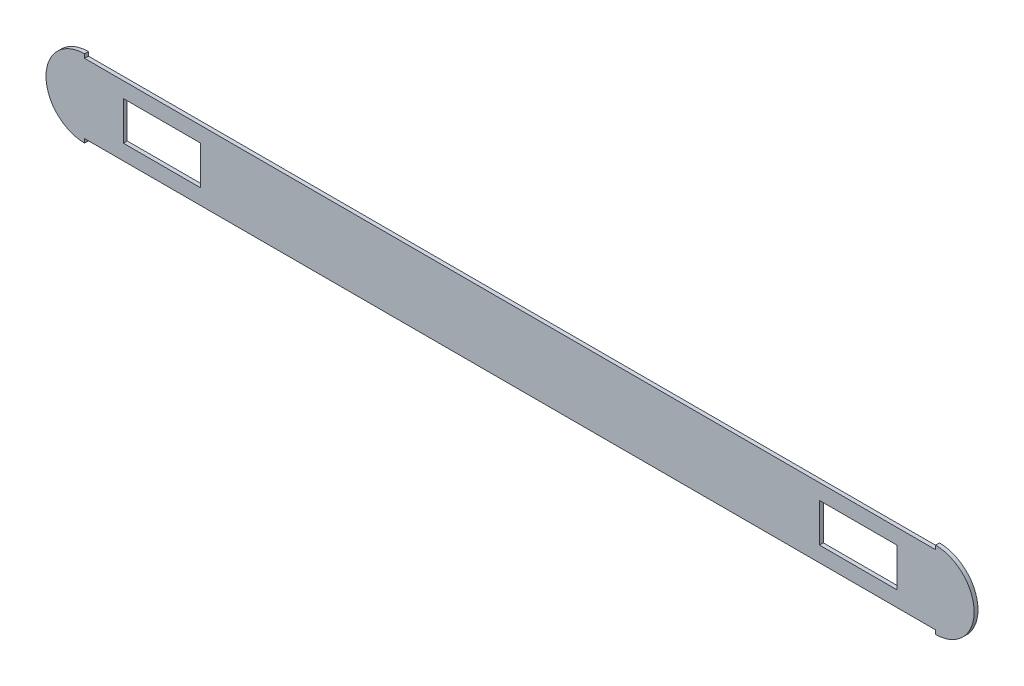
ISO-10303-21;
HEADER;
FILE_DESCRIPTION(('STEP AP214'),'2;1');
FILE_NAME('part.step','',(''),(''),'','','');
FILE_SCHEMA(('AUTOMOTIVE_DESIGN { 1 0 10303 214 1 1 1 1 }'));
ENDSEC;
DATA;
#1=APPLICATION_CONTEXT('core data for automotive mechanical design processes');
#2=APPLICATION_PROTOCOL_DEFINITION('international standard','automotive_design',2000,#1);
#3=PRODUCT_CONTEXT('',#1,'mechanical');
#4=PRODUCT('Part','Part','',(#3));
#5=PRODUCT_RELATED_PRODUCT_CATEGORY('part','',(#4));
#6=PRODUCT_DEFINITION_FORMATION('','',#4);
#7=PRODUCT_DEFINITION_CONTEXT('part definition',#1,'design');
#8=PRODUCT_DEFINITION('design','',#6,#7);
#9=PRODUCT_DEFINITION_SHAPE('','',#8);
#10=(LENGTH_UNIT() NAMED_UNIT(*) SI_UNIT(.MILLI.,.METRE.));
#11=(NAMED_UNIT(*) PLANE_ANGLE_UNIT() SI_UNIT($,.RADIAN.));
#12=(NAMED_UNIT(*) SI_UNIT($,.STERADIAN.) SOLID_ANGLE_UNIT());
#13=UNCERTAINTY_MEASURE_WITH_UNIT(LENGTH_MEASURE(1.E-05),#10,'distance_accuracy_value','');
#14=(GEOMETRIC_REPRESENTATION_CONTEXT(3) GLOBAL_UNCERTAINTY_ASSIGNED_CONTEXT((#13)) GLOBAL_UNIT_ASSIGNED_CONTEXT((#10,
#11,#12)) REPRESENTATION_CONTEXT('',''));
#15=CARTESIAN_POINT('',(0.,0.,0.));
#16=DIRECTION('',(0.,0.,1.));
#17=DIRECTION('',(1.,0.,0.));
#18=AXIS2_PLACEMENT_3D('',#15,#16,#17);
#19=CARTESIAN_POINT('',(597.266258042068,-45.,5.));
#20=DIRECTION('',(0.,0.,1.));
#21=DIRECTION('',(1.,0.,0.));
#22=AXIS2_PLACEMENT_3D('',#19,#20,#21);
#23=PLANE('',#22);
#24=DIRECTION('',(0.,1.,0.));
#25=VECTOR('',#24,1.);
#26=CARTESIAN_POINT('',(-502.833741957932,-50.1,5.));
#27=LINE('',#26,#25);
#28=CARTESIAN_POINT('',(-502.833741957932,-49.9998999999,5.));
#29=VERTEX_POINT('',#28);
#30=CARTESIAN_POINT('',(-502.833741957932,-44.9,5.));
#31=VERTEX_POINT('',#30);
#32=EDGE_CURVE('E148',#29,#31,#27,.T.);
#33=ORIENTED_EDGE('',*,*,#32,.T.);
#34=DIRECTION('',(1.,0.,0.));
#35=VECTOR('',#34,1.);
#36=CARTESIAN_POINT('',(-502.833741957932,-44.9,5.));
#37=LINE('',#36,#35);
#38=CARTESIAN_POINT('',(597.366258042068,-44.9,5.));
#39=VERTEX_POINT('',#38);
#40=EDGE_CURVE('E159',#31,#39,#37,.T.);
#41=ORIENTED_EDGE('',*,*,#40,.T.);
#42=DIRECTION('',(0.,-1.,0.));
#43=VECTOR('',#42,1.);
#44=CARTESIAN_POINT('',(597.366258042068,-44.9,5.));
#45=LINE('',#44,#43);
#46=CARTESIAN_POINT('',(597.366258042068,-49.9998999999,5.));
#47=VERTEX_POINT('',#46);
#48=EDGE_CURVE('E156',#39,#47,#45,.T.);
#49=ORIENTED_EDGE('',*,*,#48,.T.);
#50=CARTESIAN_POINT('',(597.266258042068,0.,5.));
#51=DIRECTION('',(0.,0.,1.));
#52=DIRECTION('',(1.,0.,0.));
#53=AXIS2_PLACEMENT_3D('',#50,#51,#52);
#54=CIRCLE('',#53,50.);
#55=CARTESIAN_POINT('',(597.366258042068,49.9998999999,5.));
#56=VERTEX_POINT('',#55);
#57=EDGE_CURVE('E53',#47,#56,#54,.T.);
#58=ORIENTED_EDGE('',*,*,#57,.T.);
#59=DIRECTION('',(0.,-1.,0.));
#60=VECTOR('',#59,1.);
#61=CARTESIAN_POINT('',(597.366258042068,50.1,5.));
#62=LINE('',#61,#60);
#63=CARTESIAN_POINT('',(597.366258042068,44.9,5.));
#64=VERTEX_POINT('',#63);
#65=EDGE_CURVE('E181',#56,#64,#62,.T.);
#66=ORIENTED_EDGE('',*,*,#65,.T.);
#67=DIRECTION('',(-1.,0.,0.));
#68=VECTOR('',#67,1.);
#69=CARTESIAN_POINT('',(597.366258042068,44.9,5.));
#70=LINE('',#69,#68);
#71=CARTESIAN_POINT('',(-502.833741957932,44.9,5.));
#72=VERTEX_POINT('',#71);
#73=EDGE_CURVE('E184',#64,#72,#70,.T.);
#74=ORIENTED_EDGE('',*,*,#73,.T.);
#75=DIRECTION('',(0.,1.,0.));
#76=VECTOR('',#75,1.);
#77=CARTESIAN_POINT('',(-502.833741957932,44.9,5.));
#78=LINE('',#77,#76);
#79=CARTESIAN_POINT('',(-502.833741957932,49.9998999999,5.));
#80=VERTEX_POINT('',#79);
#81=EDGE_CURVE('E179',#72,#80,#78,.T.);
#82=ORIENTED_EDGE('',*,*,#81,.T.);
#83=CARTESIAN_POINT('',(-502.733741957931,0.,5.));
#84=DIRECTION('',(0.,0.,1.));
#85=DIRECTION('',(1.,0.,0.));
#86=AXIS2_PLACEMENT_3D('',#83,#84,#85);
#87=CIRCLE('',#86,50.);
#88=EDGE_CURVE('E167',#80,#29,#87,.T.);
#89=ORIENTED_EDGE('',*,*,#88,.T.);
#90=EDGE_LOOP('',(#33,#41,#49,#58,#66,#74,#82,#89));
#91=FACE_BOUND('',#90,.T.);
#92=DIRECTION('',(0.,-1.,0.));
#93=VECTOR('',#92,1.);
#94=CARTESIAN_POINT('',(-452.733741957932,25.,5.));
#95=LINE('',#94,#93);
#96=CARTESIAN_POINT('',(-452.733741957932,25.,5.));
#97=VERTEX_POINT('',#96);
#98=CARTESIAN_POINT('',(-452.733741957931,-25.,5.));
#99=VERTEX_POINT('',#98);
#100=EDGE_CURVE('E201',#97,#99,#95,.T.);
#101=ORIENTED_EDGE('',*,*,#100,.F.);
#102=DIRECTION('',(-1.,0.,0.));
#103=VECTOR('',#102,1.);
#104=CARTESIAN_POINT('',(-452.733741957932,25.,5.));
#105=LINE('',#104,#103);
#106=CARTESIAN_POINT('',(-352.733741957931,25.,5.));
#107=VERTEX_POINT('',#106);
#108=EDGE_CURVE('E210',#107,#97,#105,.T.);
#109=ORIENTED_EDGE('',*,*,#108,.F.);
#110=DIRECTION('',(0.,1.,0.));
#111=VECTOR('',#110,1.);
#112=CARTESIAN_POINT('',(-352.733741957931,25.,5.));
#113=LINE('',#112,#111);
#114=CARTESIAN_POINT('',(-352.733741957931,-25.,5.));
#115=VERTEX_POINT('',#114);
#116=EDGE_CURVE('E207',#115,#107,#113,.T.);
#117=ORIENTED_EDGE('',*,*,#116,.F.);
#118=DIRECTION('',(1.,0.,0.));
#119=VECTOR('',#118,1.);
#120=CARTESIAN_POINT('',(-452.733741957932,-25.,5.));
#121=LINE('',#120,#119);
#122=EDGE_CURVE('E203',#99,#115,#121,.T.);
#123=ORIENTED_EDGE('',*,*,#122,.F.);
#124=EDGE_LOOP('',(#101,#109,#117,#123));
#125=FACE_BOUND('',#124,.T.);
#126=DIRECTION('',(0.,-1.,0.));
#127=VECTOR('',#126,1.);
#128=CARTESIAN_POINT('',(447.266258042068,25.,5.));
#129=LINE('',#128,#127);
#130=CARTESIAN_POINT('',(447.266258042068,25.,5.));
#131=VERTEX_POINT('',#130);
#132=CARTESIAN_POINT('',(447.266258042068,-25.,5.));
#133=VERTEX_POINT('',#132);
#134=EDGE_CURVE('E200',#131,#133,#129,.T.);
#135=ORIENTED_EDGE('',*,*,#134,.F.);
#136=DIRECTION('',(-1.,0.,0.));
#137=VECTOR('',#136,1.);
#138=CARTESIAN_POINT('',(447.266258042068,25.,5.));
#139=LINE('',#138,#137);
#140=CARTESIAN_POINT('',(547.266258042068,25.,5.));
#141=VERTEX_POINT('',#140);
#142=EDGE_CURVE('E230',#141,#131,#139,.T.);
#143=ORIENTED_EDGE('',*,*,#142,.F.);
#144=DIRECTION('',(0.,1.,0.));
#145=VECTOR('',#144,1.);
#146=CARTESIAN_POINT('',(547.266258042068,25.,5.));
#147=LINE('',#146,#145);
#148=CARTESIAN_POINT('',(547.266258042068,-25.,5.));
#149=VERTEX_POINT('',#148);
#150=EDGE_CURVE('E227',#149,#141,#147,.T.);
#151=ORIENTED_EDGE('',*,*,#150,.F.);
#152=DIRECTION('',(1.,0.,0.));
#153=VECTOR('',#152,1.);
#154=CARTESIAN_POINT('',(447.266258042068,-25.,5.));
#155=LINE('',#154,#153);
#156=EDGE_CURVE('E224',#133,#149,#155,.T.);
#157=ORIENTED_EDGE('',*,*,#156,.F.);
#158=EDGE_LOOP('',(#135,#143,#151,#157));
#159=FACE_BOUND('',#158,.T.);
#160=ADVANCED_FACE('F32',(#91,#125,#159),#23,.T.);
#161=CARTESIAN_POINT('',(-502.733741957931,0.,80.));
#162=DIRECTION('',(0.,0.,-1.));
#163=DIRECTION('',(-1.,0.,0.));
#164=AXIS2_PLACEMENT_3D('',#161,#162,#163);
#165=CYLINDRICAL_SURFACE('',#164,50.);
#166=CARTESIAN_POINT('',(-502.733741957931,0.,0.));
#167=DIRECTION('',(0.,0.,1.));
#168=DIRECTION('',(1.,0.,0.));
#169=AXIS2_PLACEMENT_3D('',#166,#167,#168);
#170=CIRCLE('',#169,50.);
#171=CARTESIAN_POINT('',(-502.833741957932,49.9998999999,0.));
#172=VERTEX_POINT('',#171);
#173=CARTESIAN_POINT('',(-502.833741957932,-49.9998999999,0.));
#174=VERTEX_POINT('',#173);
#175=EDGE_CURVE('E266',#172,#174,#170,.T.);
#176=ORIENTED_EDGE('',*,*,#175,.T.);
#177=DIRECTION('',(0.,0.,-1.));
#178=VECTOR('',#177,1.);
#179=CARTESIAN_POINT('',(-502.833741957932,-49.9998999999,80.));
#180=LINE('',#179,#178);
#181=EDGE_CURVE('E175',#174,#29,#180,.F.);
#182=ORIENTED_EDGE('',*,*,#181,.T.);
#183=ORIENTED_EDGE('',*,*,#88,.F.);
#184=DIRECTION('',(0.,0.,-1.));
#185=VECTOR('',#184,1.);
#186=CARTESIAN_POINT('',(-502.833741957932,49.9998999999,80.));
#187=LINE('',#186,#185);
#188=EDGE_CURVE('E195',#80,#172,#187,.T.);
#189=ORIENTED_EDGE('',*,*,#188,.T.);
#190=EDGE_LOOP('',(#176,#182,#183,#189));
#191=FACE_BOUND('',#190,.T.);
#192=ADVANCED_FACE('F290',(#191),#165,.T.);
#193=CARTESIAN_POINT('',(-502.733741957931,0.,0.));
#194=DIRECTION('',(0.,0.,1.));
#195=DIRECTION('',(1.,0.,0.));
#196=AXIS2_PLACEMENT_3D('',#193,#194,#195);
#197=PLANE('',#196);
#198=DIRECTION('',(1.,0.,0.));
#199=VECTOR('',#198,1.);
#200=CARTESIAN_POINT('',(-502.833741957932,-44.9,0.));
#201=LINE('',#200,#199);
#202=CARTESIAN_POINT('',(-502.833741957932,-44.9,0.));
#203=VERTEX_POINT('',#202);
#204=CARTESIAN_POINT('',(597.366258042068,-44.9,0.));
#205=VERTEX_POINT('',#204);
#206=EDGE_CURVE('E169',#203,#205,#201,.T.);
#207=ORIENTED_EDGE('',*,*,#206,.F.);
#208=DIRECTION('',(0.,1.,0.));
#209=VECTOR('',#208,1.);
#210=CARTESIAN_POINT('',(-502.833741957932,-50.1,0.));
#211=LINE('',#210,#209);
#212=EDGE_CURVE('E151',#174,#203,#211,.T.);
#213=ORIENTED_EDGE('',*,*,#212,.F.);
#214=ORIENTED_EDGE('',*,*,#175,.F.);
#215=DIRECTION('',(0.,1.,0.));
#216=VECTOR('',#215,1.);
#217=CARTESIAN_POINT('',(-502.833741957932,44.9,0.));
#218=LINE('',#217,#216);
#219=CARTESIAN_POINT('',(-502.833741957932,44.9,0.));
#220=VERTEX_POINT('',#219);
#221=EDGE_CURVE('E178',#220,#172,#218,.T.);
#222=ORIENTED_EDGE('',*,*,#221,.F.);
#223=DIRECTION('',(-1.,0.,0.));
#224=VECTOR('',#223,1.);
#225=CARTESIAN_POINT('',(597.366258042068,44.9,0.));
#226=LINE('',#225,#224);
#227=CARTESIAN_POINT('',(597.366258042068,44.9,0.));
#228=VERTEX_POINT('',#227);
#229=EDGE_CURVE('E182',#228,#220,#226,.T.);
#230=ORIENTED_EDGE('',*,*,#229,.F.);
#231=DIRECTION('',(0.,-1.,0.));
#232=VECTOR('',#231,1.);
#233=CARTESIAN_POINT('',(597.366258042068,50.1,0.));
#234=LINE('',#233,#232);
#235=CARTESIAN_POINT('',(597.366258042068,49.9998999999,0.));
#236=VERTEX_POINT('',#235);
#237=EDGE_CURVE('E189',#236,#228,#234,.T.);
#238=ORIENTED_EDGE('',*,*,#237,.F.);
#239=CARTESIAN_POINT('',(597.266258042068,0.,0.));
#240=DIRECTION('',(0.,0.,1.));
#241=DIRECTION('',(1.,0.,0.));
#242=AXIS2_PLACEMENT_3D('',#239,#240,#241);
#243=CIRCLE('',#242,50.);
#244=CARTESIAN_POINT('',(597.366258042068,-49.9998999999,0.));
#245=VERTEX_POINT('',#244);
#246=EDGE_CURVE('E264',#245,#236,#243,.T.);
#247=ORIENTED_EDGE('',*,*,#246,.F.);
#248=DIRECTION('',(0.,-1.,0.));
#249=VECTOR('',#248,1.);
#250=CARTESIAN_POINT('',(597.366258042068,-44.9,0.));
#251=LINE('',#250,#249);
#252=EDGE_CURVE('E46',#205,#245,#251,.T.);
#253=ORIENTED_EDGE('',*,*,#252,.F.);
#254=EDGE_LOOP('',(#207,#213,#214,#222,#230,#238,#247,#253));
#255=FACE_BOUND('',#254,.T.);
#256=DIRECTION('',(-1.,0.,0.));
#257=VECTOR('',#256,1.);
#258=CARTESIAN_POINT('',(-502.733741957931,25.,0.));
#259=LINE('',#258,#257);
#260=CARTESIAN_POINT('',(-352.733741957931,25.,0.));
#261=VERTEX_POINT('',#260);
#262=CARTESIAN_POINT('',(-452.733741957932,25.,0.));
#263=VERTEX_POINT('',#262);
#264=EDGE_CURVE('E258',#261,#263,#259,.T.);
#265=ORIENTED_EDGE('',*,*,#264,.T.);
#266=DIRECTION('',(0.,-1.,0.));
#267=VECTOR('',#266,1.);
#268=CARTESIAN_POINT('',(-452.733741957932,0.,0.));
#269=LINE('',#268,#267);
#270=CARTESIAN_POINT('',(-452.733741957932,-25.,0.));
#271=VERTEX_POINT('',#270);
#272=EDGE_CURVE('E261',#263,#271,#269,.T.);
#273=ORIENTED_EDGE('',*,*,#272,.T.);
#274=DIRECTION('',(1.,0.,0.));
#275=VECTOR('',#274,1.);
#276=CARTESIAN_POINT('',(-502.733741957931,-25.,0.));
#277=LINE('',#276,#275);
#278=CARTESIAN_POINT('',(-352.733741957931,-25.,0.));
#279=VERTEX_POINT('',#278);
#280=EDGE_CURVE('E252',#271,#279,#277,.T.);
#281=ORIENTED_EDGE('',*,*,#280,.T.);
#282=DIRECTION('',(0.,1.,0.));
#283=VECTOR('',#282,1.);
#284=CARTESIAN_POINT('',(-352.733741957931,0.,0.));
#285=LINE('',#284,#283);
#286=EDGE_CURVE('E255',#279,#261,#285,.T.);
#287=ORIENTED_EDGE('',*,*,#286,.T.);
#288=EDGE_LOOP('',(#265,#273,#281,#287));
#289=FACE_BOUND('',#288,.T.);
#290=DIRECTION('',(-1.,0.,0.));
#291=VECTOR('',#290,1.);
#292=CARTESIAN_POINT('',(-502.733741957931,25.0000000000004,0.));
#293=LINE('',#292,#291);
#294=CARTESIAN_POINT('',(547.266258042068,25.,0.));
#295=VERTEX_POINT('',#294);
#296=CARTESIAN_POINT('',(447.266258042068,25.,0.));
#297=VERTEX_POINT('',#296);
#298=EDGE_CURVE('E246',#295,#297,#293,.T.);
#299=ORIENTED_EDGE('',*,*,#298,.T.);
#300=DIRECTION('',(0.,-1.,0.));
#301=VECTOR('',#300,1.);
#302=CARTESIAN_POINT('',(447.266258042068,0.,0.));
#303=LINE('',#302,#301);
#304=CARTESIAN_POINT('',(447.266258042068,-25.,0.));
#305=VERTEX_POINT('',#304);
#306=EDGE_CURVE('E249',#297,#305,#303,.T.);
#307=ORIENTED_EDGE('',*,*,#306,.T.);
#308=DIRECTION('',(1.,0.,0.));
#309=VECTOR('',#308,1.);
#310=CARTESIAN_POINT('',(-502.733741957931,-25.,0.));
#311=LINE('',#310,#309);
#312=CARTESIAN_POINT('',(547.266258042068,-25.,0.));
#313=VERTEX_POINT('',#312);
#314=EDGE_CURVE('E216',#305,#313,#311,.T.);
#315=ORIENTED_EDGE('',*,*,#314,.T.);
#316=DIRECTION('',(0.,1.,0.));
#317=VECTOR('',#316,1.);
#318=CARTESIAN_POINT('',(547.266258042068,0.,0.));
#319=LINE('',#318,#317);
#320=EDGE_CURVE('E243',#313,#295,#319,.T.);
#321=ORIENTED_EDGE('',*,*,#320,.T.);
#322=EDGE_LOOP('',(#299,#307,#315,#321));
#323=FACE_BOUND('',#322,.T.);
#324=ADVANCED_FACE('F280',(#255,#289,#323),#197,.F.);
#325=CARTESIAN_POINT('',(447.266258042068,-25.,-5.));
#326=DIRECTION('',(0.,-1.,0.));
#327=DIRECTION('',(0.,0.,-1.));
#328=AXIS2_PLACEMENT_3D('',#325,#326,#327);
#329=PLANE('',#328);
#330=DIRECTION('',(0.,0.,1.));
#331=VECTOR('',#330,1.);
#332=CARTESIAN_POINT('',(447.266258042068,-25.,-5.));
#333=LINE('',#332,#331);
#334=EDGE_CURVE('E233',#305,#133,#333,.T.);
#335=ORIENTED_EDGE('',*,*,#334,.T.);
#336=ORIENTED_EDGE('',*,*,#156,.T.);
#337=DIRECTION('',(0.,0.,1.));
#338=VECTOR('',#337,1.);
#339=CARTESIAN_POINT('',(547.266258042068,-25.,-5.));
#340=LINE('',#339,#338);
#341=EDGE_CURVE('E237',#313,#149,#340,.T.);
#342=ORIENTED_EDGE('',*,*,#341,.F.);
#343=ORIENTED_EDGE('',*,*,#314,.F.);
#344=EDGE_LOOP('',(#335,#336,#342,#343));
#345=FACE_BOUND('',#344,.T.);
#346=ADVANCED_FACE('F294',(#345),#329,.F.);
#347=CARTESIAN_POINT('',(547.266258042068,25.,-5.));
#348=DIRECTION('',(1.,0.,0.));
#349=DIRECTION('',(0.,0.,-1.));
#350=AXIS2_PLACEMENT_3D('',#347,#348,#349);
#351=PLANE('',#350);
#352=ORIENTED_EDGE('',*,*,#341,.T.);
#353=ORIENTED_EDGE('',*,*,#150,.T.);
#354=DIRECTION('',(0.,0.,1.));
#355=VECTOR('',#354,1.);
#356=CARTESIAN_POINT('',(547.266258042068,25.,-5.));
#357=LINE('',#356,#355);
#358=EDGE_CURVE('E235',#295,#141,#357,.T.);
#359=ORIENTED_EDGE('',*,*,#358,.F.);
#360=ORIENTED_EDGE('',*,*,#320,.F.);
#361=EDGE_LOOP('',(#352,#353,#359,#360));
#362=FACE_BOUND('',#361,.T.);
#363=ADVANCED_FACE('F304',(#362),#351,.F.);
#364=CARTESIAN_POINT('',(447.266258042068,25.,-5.));
#365=DIRECTION('',(0.,1.,0.));
#366=DIRECTION('',(-1.,0.,0.));
#367=AXIS2_PLACEMENT_3D('',#364,#365,#366);
#368=PLANE('',#367);
#369=ORIENTED_EDGE('',*,*,#358,.T.);
#370=ORIENTED_EDGE('',*,*,#142,.T.);
#371=DIRECTION('',(0.,0.,1.));
#372=VECTOR('',#371,1.);
#373=CARTESIAN_POINT('',(447.266258042068,25.,-5.));
#374=LINE('',#373,#372);
#375=EDGE_CURVE('E204',#297,#131,#374,.T.);
#376=ORIENTED_EDGE('',*,*,#375,.F.);
#377=ORIENTED_EDGE('',*,*,#298,.F.);
#378=EDGE_LOOP('',(#369,#370,#376,#377));
#379=FACE_BOUND('',#378,.T.);
#380=ADVANCED_FACE('F316',(#379),#368,.F.);
#381=CARTESIAN_POINT('',(447.266258042068,25.,-5.));
#382=DIRECTION('',(-1.,0.,0.));
#383=DIRECTION('',(0.,0.,1.));
#384=AXIS2_PLACEMENT_3D('',#381,#382,#383);
#385=PLANE('',#384);
#386=ORIENTED_EDGE('',*,*,#375,.T.);
#387=ORIENTED_EDGE('',*,*,#134,.T.);
#388=ORIENTED_EDGE('',*,*,#334,.F.);
#389=ORIENTED_EDGE('',*,*,#306,.F.);
#390=EDGE_LOOP('',(#386,#387,#388,#389));
#391=FACE_BOUND('',#390,.T.);
#392=ADVANCED_FACE('F313',(#391),#385,.F.);
#393=CARTESIAN_POINT('',(-452.733741957932,-25.,-5.));
#394=DIRECTION('',(0.,-1.,0.));
#395=DIRECTION('',(0.,0.,-1.));
#396=AXIS2_PLACEMENT_3D('',#393,#394,#395);
#397=PLANE('',#396);
#398=DIRECTION('',(0.,0.,1.));
#399=VECTOR('',#398,1.);
#400=CARTESIAN_POINT('',(-452.733741957932,-25.,-5.));
#401=LINE('',#400,#399);
#402=EDGE_CURVE('E213',#271,#99,#401,.T.);
#403=ORIENTED_EDGE('',*,*,#402,.T.);
#404=ORIENTED_EDGE('',*,*,#122,.T.);
#405=DIRECTION('',(0.,0.,1.));
#406=VECTOR('',#405,1.);
#407=CARTESIAN_POINT('',(-352.733741957931,-25.,-5.));
#408=LINE('',#407,#406);
#409=EDGE_CURVE('E219',#279,#115,#408,.T.);
#410=ORIENTED_EDGE('',*,*,#409,.F.);
#411=ORIENTED_EDGE('',*,*,#280,.F.);
#412=EDGE_LOOP('',(#403,#404,#410,#411));
#413=FACE_BOUND('',#412,.T.);
#414=ADVANCED_FACE('F315',(#413),#397,.F.);
#415=CARTESIAN_POINT('',(-352.733741957931,25.,-5.));
#416=DIRECTION('',(1.,0.,0.));
#417=DIRECTION('',(0.,0.,-1.));
#418=AXIS2_PLACEMENT_3D('',#415,#416,#417);
#419=PLANE('',#418);
#420=ORIENTED_EDGE('',*,*,#409,.T.);
#421=ORIENTED_EDGE('',*,*,#116,.T.);
#422=DIRECTION('',(0.,0.,1.));
#423=VECTOR('',#422,1.);
#424=CARTESIAN_POINT('',(-352.733741957931,25.,-5.));
#425=LINE('',#424,#423);
#426=EDGE_CURVE('E217',#261,#107,#425,.T.);
#427=ORIENTED_EDGE('',*,*,#426,.F.);
#428=ORIENTED_EDGE('',*,*,#286,.F.);
#429=EDGE_LOOP('',(#420,#421,#427,#428));
#430=FACE_BOUND('',#429,.T.);
#431=ADVANCED_FACE('F331',(#430),#419,.F.);
#432=CARTESIAN_POINT('',(-452.733741957932,25.,-5.));
#433=DIRECTION('',(0.,1.,0.));
#434=DIRECTION('',(0.,0.,1.));
#435=AXIS2_PLACEMENT_3D('',#432,#433,#434);
#436=PLANE('',#435);
#437=ORIENTED_EDGE('',*,*,#426,.T.);
#438=ORIENTED_EDGE('',*,*,#108,.T.);
#439=DIRECTION('',(0.,0.,1.));
#440=VECTOR('',#439,1.);
#441=CARTESIAN_POINT('',(-452.733741957932,25.,-5.));
#442=LINE('',#441,#440);
#443=EDGE_CURVE('E214',#263,#97,#442,.T.);
#444=ORIENTED_EDGE('',*,*,#443,.F.);
#445=ORIENTED_EDGE('',*,*,#264,.F.);
#446=EDGE_LOOP('',(#437,#438,#444,#445));
#447=FACE_BOUND('',#446,.T.);
#448=ADVANCED_FACE('F327',(#447),#436,.F.);
#449=CARTESIAN_POINT('',(-452.733741957932,25.,-5.));
#450=DIRECTION('',(-1.,0.,0.));
#451=DIRECTION('',(0.,0.,1.));
#452=AXIS2_PLACEMENT_3D('',#449,#450,#451);
#453=PLANE('',#452);
#454=ORIENTED_EDGE('',*,*,#443,.T.);
#455=ORIENTED_EDGE('',*,*,#100,.T.);
#456=ORIENTED_EDGE('',*,*,#402,.F.);
#457=ORIENTED_EDGE('',*,*,#272,.F.);
#458=EDGE_LOOP('',(#454,#455,#456,#457));
#459=FACE_BOUND('',#458,.T.);
#460=ADVANCED_FACE('F300',(#459),#453,.F.);
#461=CARTESIAN_POINT('',(597.266258042068,0.,80.));
#462=DIRECTION('',(0.,0.,-1.));
#463=DIRECTION('',(-1.,0.,0.));
#464=AXIS2_PLACEMENT_3D('',#461,#462,#463);
#465=CYLINDRICAL_SURFACE('',#464,50.);
#466=ORIENTED_EDGE('',*,*,#57,.F.);
#467=DIRECTION('',(0.,0.,-1.));
#468=VECTOR('',#467,1.);
#469=CARTESIAN_POINT('',(597.366258042068,-49.9998999999,80.));
#470=LINE('',#469,#468);
#471=EDGE_CURVE('E11',#47,#245,#470,.T.);
#472=ORIENTED_EDGE('',*,*,#471,.T.);
#473=ORIENTED_EDGE('',*,*,#246,.T.);
#474=DIRECTION('',(0.,0.,-1.));
#475=VECTOR('',#474,1.);
#476=CARTESIAN_POINT('',(597.366258042068,49.9998999999,80.));
#477=LINE('',#476,#475);
#478=EDGE_CURVE('E39',#236,#56,#477,.F.);
#479=ORIENTED_EDGE('',*,*,#478,.T.);
#480=EDGE_LOOP('',(#466,#472,#473,#479));
#481=FACE_BOUND('',#480,.T.);
#482=ADVANCED_FACE('F273',(#481),#465,.T.);
#483=CARTESIAN_POINT('',(-502.833741957932,44.9,5.));
#484=DIRECTION('',(-1.,0.,0.));
#485=DIRECTION('',(0.,0.,1.));
#486=AXIS2_PLACEMENT_3D('',#483,#484,#485);
#487=PLANE('',#486);
#488=ORIENTED_EDGE('',*,*,#81,.F.);
#489=DIRECTION('',(0.,0.,-1.));
#490=VECTOR('',#489,1.);
#491=CARTESIAN_POINT('',(-502.833741957932,44.9,5.));
#492=LINE('',#491,#490);
#493=EDGE_CURVE('E193',#72,#220,#492,.T.);
#494=ORIENTED_EDGE('',*,*,#493,.T.);
#495=ORIENTED_EDGE('',*,*,#221,.T.);
#496=ORIENTED_EDGE('',*,*,#188,.F.);
#497=EDGE_LOOP('',(#488,#494,#495,#496));
#498=FACE_BOUND('',#497,.T.);
#499=ADVANCED_FACE('F291',(#498),#487,.F.);
#500=CARTESIAN_POINT('',(597.366258042068,50.1,5.));
#501=DIRECTION('',(1.,0.,0.));
#502=DIRECTION('',(0.,0.,-1.));
#503=AXIS2_PLACEMENT_3D('',#500,#501,#502);
#504=PLANE('',#503);
#505=ORIENTED_EDGE('',*,*,#237,.T.);
#506=DIRECTION('',(0.,0.,-1.));
#507=VECTOR('',#506,1.);
#508=CARTESIAN_POINT('',(597.366258042068,44.9,5.));
#509=LINE('',#508,#507);
#510=EDGE_CURVE('E187',#64,#228,#509,.T.);
#511=ORIENTED_EDGE('',*,*,#510,.F.);
#512=ORIENTED_EDGE('',*,*,#65,.F.);
#513=ORIENTED_EDGE('',*,*,#478,.F.);
#514=EDGE_LOOP('',(#505,#511,#512,#513));
#515=FACE_BOUND('',#514,.T.);
#516=ADVANCED_FACE('F277',(#515),#504,.F.);
#517=CARTESIAN_POINT('',(597.366258042068,44.9,5.));
#518=DIRECTION('',(0.,-1.,0.));
#519=DIRECTION('',(0.,0.,-1.));
#520=AXIS2_PLACEMENT_3D('',#517,#518,#519);
#521=PLANE('',#520);
#522=ORIENTED_EDGE('',*,*,#229,.T.);
#523=ORIENTED_EDGE('',*,*,#493,.F.);
#524=ORIENTED_EDGE('',*,*,#73,.F.);
#525=ORIENTED_EDGE('',*,*,#510,.T.);
#526=EDGE_LOOP('',(#522,#523,#524,#525));
#527=FACE_BOUND('',#526,.T.);
#528=ADVANCED_FACE('F285',(#527),#521,.F.);
#529=CARTESIAN_POINT('',(-502.833741957932,-50.1,5.));
#530=DIRECTION('',(-1.,0.,0.));
#531=DIRECTION('',(0.,0.,1.));
#532=AXIS2_PLACEMENT_3D('',#529,#530,#531);
#533=PLANE('',#532);
#534=ORIENTED_EDGE('',*,*,#212,.T.);
#535=DIRECTION('',(0.,0.,-1.));
#536=VECTOR('',#535,1.);
#537=CARTESIAN_POINT('',(-502.833741957932,-44.9,5.));
#538=LINE('',#537,#536);
#539=EDGE_CURVE('E144',#31,#203,#538,.T.);
#540=ORIENTED_EDGE('',*,*,#539,.F.);
#541=ORIENTED_EDGE('',*,*,#32,.F.);
#542=ORIENTED_EDGE('',*,*,#181,.F.);
#543=EDGE_LOOP('',(#534,#540,#541,#542));
#544=FACE_BOUND('',#543,.T.);
#545=ADVANCED_FACE('F146',(#544),#533,.F.);
#546=CARTESIAN_POINT('',(597.366258042068,-44.9,5.));
#547=DIRECTION('',(1.,0.,0.));
#548=DIRECTION('',(0.,0.,-1.));
#549=AXIS2_PLACEMENT_3D('',#546,#547,#548);
#550=PLANE('',#549);
#551=ORIENTED_EDGE('',*,*,#48,.F.);
#552=DIRECTION('',(0.,0.,-1.));
#553=VECTOR('',#552,1.);
#554=CARTESIAN_POINT('',(597.366258042068,-44.9,5.));
#555=LINE('',#554,#553);
#556=EDGE_CURVE('E155',#39,#205,#555,.T.);
#557=ORIENTED_EDGE('',*,*,#556,.T.);
#558=ORIENTED_EDGE('',*,*,#252,.T.);
#559=ORIENTED_EDGE('',*,*,#471,.F.);
#560=EDGE_LOOP('',(#551,#557,#558,#559));
#561=FACE_BOUND('',#560,.T.);
#562=ADVANCED_FACE('F451',(#561),#550,.F.);
#563=CARTESIAN_POINT('',(-502.833741957932,-44.9,5.));
#564=DIRECTION('',(0.,1.,0.));
#565=DIRECTION('',(0.,0.,1.));
#566=AXIS2_PLACEMENT_3D('',#563,#564,#565);
#567=PLANE('',#566);
#568=ORIENTED_EDGE('',*,*,#206,.T.);
#569=ORIENTED_EDGE('',*,*,#556,.F.);
#570=ORIENTED_EDGE('',*,*,#40,.F.);
#571=ORIENTED_EDGE('',*,*,#539,.T.);
#572=EDGE_LOOP('',(#568,#569,#570,#571));
#573=FACE_BOUND('',#572,.T.);
#574=ADVANCED_FACE('F160',(#573),#567,.F.);
#575=CLOSED_SHELL('',(#160,#192,#324,#346,#363,#380,#392,#414,#431,#448,#460,#482,#499,#516,
#528,#545,#562,#574));
#576=MANIFOLD_SOLID_BREP('B2',#575);
#577=ADVANCED_BREP_SHAPE_REPRESENTATION('',(#18,#576),#14);
#578=SHAPE_DEFINITION_REPRESENTATION(#9,#577);
ENDSEC;
END-ISO-10303-21;
